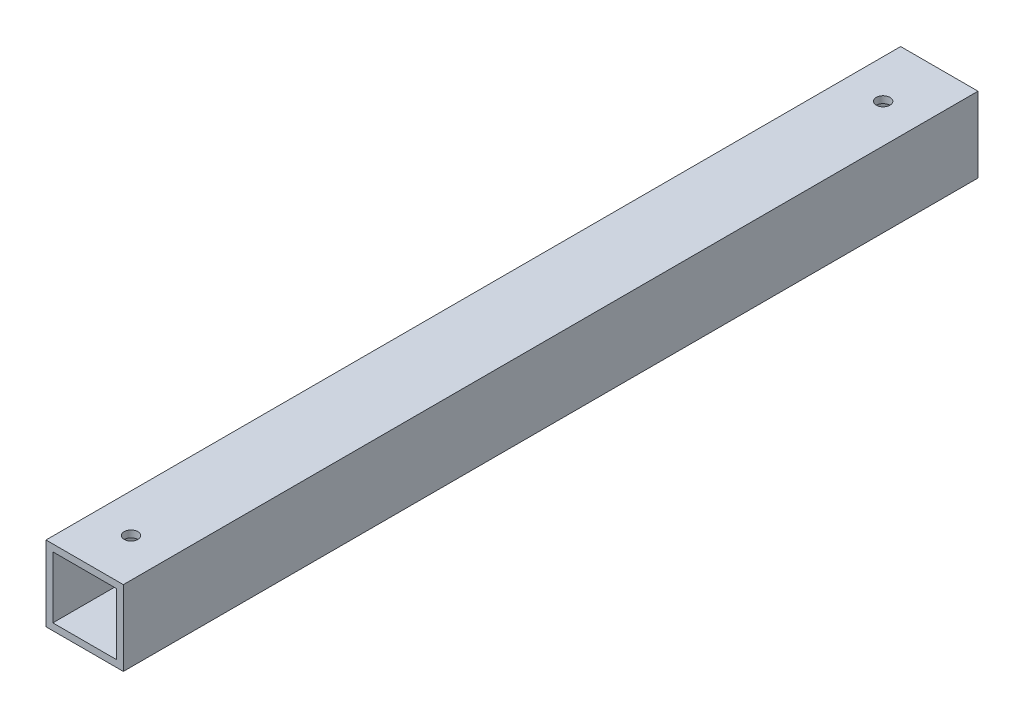
ISO-10303-21;
HEADER;
FILE_DESCRIPTION(('STEP AP214'),'2;1');
FILE_NAME('part.step','',(''),(''),'','','');
FILE_SCHEMA(('AUTOMOTIVE_DESIGN { 1 0 10303 214 1 1 1 1 }'));
ENDSEC;
DATA;
#1=APPLICATION_CONTEXT('core data for automotive mechanical design processes');
#2=APPLICATION_PROTOCOL_DEFINITION('international standard','automotive_design',2000,#1);
#3=PRODUCT_CONTEXT('',#1,'mechanical');
#4=PRODUCT('Part','Part','',(#3));
#5=PRODUCT_RELATED_PRODUCT_CATEGORY('part','',(#4));
#6=PRODUCT_DEFINITION_FORMATION('','',#4);
#7=PRODUCT_DEFINITION_CONTEXT('part definition',#1,'design');
#8=PRODUCT_DEFINITION('design','',#6,#7);
#9=PRODUCT_DEFINITION_SHAPE('','',#8);
#10=(LENGTH_UNIT() NAMED_UNIT(*) SI_UNIT(.MILLI.,.METRE.));
#11=(NAMED_UNIT(*) PLANE_ANGLE_UNIT() SI_UNIT($,.RADIAN.));
#12=(NAMED_UNIT(*) SI_UNIT($,.STERADIAN.) SOLID_ANGLE_UNIT());
#13=UNCERTAINTY_MEASURE_WITH_UNIT(LENGTH_MEASURE(1.E-05),#10,'distance_accuracy_value','');
#14=(GEOMETRIC_REPRESENTATION_CONTEXT(3) GLOBAL_UNCERTAINTY_ASSIGNED_CONTEXT((#13)) GLOBAL_UNIT_ASSIGNED_CONTEXT((#10,
#11,#12)) REPRESENTATION_CONTEXT('',''));
#15=CARTESIAN_POINT('',(0.,0.,0.));
#16=DIRECTION('',(0.,0.,1.));
#17=DIRECTION('',(1.,0.,0.));
#18=AXIS2_PLACEMENT_3D('',#15,#16,#17);
#19=CARTESIAN_POINT('',(0.,0.,250.));
#20=DIRECTION('',(0.,0.,1.));
#21=DIRECTION('',(1.,0.,0.));
#22=AXIS2_PLACEMENT_3D('',#19,#20,#21);
#23=PLANE('',#22);
#24=DIRECTION('',(0.,1.,0.));
#25=VECTOR('',#24,1.);
#26=CARTESIAN_POINT('',(22.625,20.,250.));
#27=LINE('',#26,#25);
#28=CARTESIAN_POINT('',(22.625,-22.,250.));
#29=VERTEX_POINT('',#28);
#30=CARTESIAN_POINT('',(22.625,22.,250.));
#31=VERTEX_POINT('',#30);
#32=EDGE_CURVE('E180',#29,#31,#27,.T.);
#33=ORIENTED_EDGE('',*,*,#32,.T.);
#34=DIRECTION('',(-1.,0.,0.));
#35=VECTOR('',#34,1.);
#36=CARTESIAN_POINT('',(-20.625,22.,250.));
#37=LINE('',#36,#35);
#38=CARTESIAN_POINT('',(-22.625,22.,250.));
#39=VERTEX_POINT('',#38);
#40=EDGE_CURVE('E184',#31,#39,#37,.T.);
#41=ORIENTED_EDGE('',*,*,#40,.T.);
#42=DIRECTION('',(0.,-1.,0.));
#43=VECTOR('',#42,1.);
#44=CARTESIAN_POINT('',(-22.625,20.,250.));
#45=LINE('',#44,#43);
#46=CARTESIAN_POINT('',(-22.625,-22.,250.));
#47=VERTEX_POINT('',#46);
#48=EDGE_CURVE('E188',#39,#47,#45,.T.);
#49=ORIENTED_EDGE('',*,*,#48,.T.);
#50=DIRECTION('',(1.,0.,0.));
#51=VECTOR('',#50,1.);
#52=CARTESIAN_POINT('',(-20.625,-22.,250.));
#53=LINE('',#52,#51);
#54=EDGE_CURVE('E191',#47,#29,#53,.T.);
#55=ORIENTED_EDGE('',*,*,#54,.T.);
#56=EDGE_LOOP('',(#33,#41,#49,#55));
#57=FACE_BOUND('',#56,.T.);
#58=DIRECTION('',(-1.,0.,0.));
#59=VECTOR('',#58,1.);
#60=CARTESIAN_POINT('',(-20.625,18.,250.));
#61=LINE('',#60,#59);
#62=CARTESIAN_POINT('',(18.625,18.,250.));
#63=VERTEX_POINT('',#62);
#64=CARTESIAN_POINT('',(-18.625,18.,250.));
#65=VERTEX_POINT('',#64);
#66=EDGE_CURVE('E139',#63,#65,#61,.T.);
#67=ORIENTED_EDGE('',*,*,#66,.F.);
#68=DIRECTION('',(0.,1.,0.));
#69=VECTOR('',#68,1.);
#70=CARTESIAN_POINT('',(18.625,20.,250.));
#71=LINE('',#70,#69);
#72=CARTESIAN_POINT('',(18.625,-18.,250.));
#73=VERTEX_POINT('',#72);
#74=EDGE_CURVE('E130',#73,#63,#71,.T.);
#75=ORIENTED_EDGE('',*,*,#74,.F.);
#76=DIRECTION('',(1.,0.,0.));
#77=VECTOR('',#76,1.);
#78=CARTESIAN_POINT('',(-20.625,-18.,250.));
#79=LINE('',#78,#77);
#80=CARTESIAN_POINT('',(-18.625,-18.,250.));
#81=VERTEX_POINT('',#80);
#82=EDGE_CURVE('E156',#81,#73,#79,.T.);
#83=ORIENTED_EDGE('',*,*,#82,.F.);
#84=DIRECTION('',(0.,-1.,0.));
#85=VECTOR('',#84,1.);
#86=CARTESIAN_POINT('',(-18.625,20.,250.));
#87=LINE('',#86,#85);
#88=EDGE_CURVE('E152',#65,#81,#87,.T.);
#89=ORIENTED_EDGE('',*,*,#88,.F.);
#90=EDGE_LOOP('',(#67,#75,#83,#89));
#91=FACE_BOUND('',#90,.T.);
#92=ADVANCED_FACE('F62',(#57,#91),#23,.T.);
#93=CARTESIAN_POINT('',(0.,0.,-250.));
#94=DIRECTION('',(0.,0.,1.));
#95=DIRECTION('',(1.,0.,0.));
#96=AXIS2_PLACEMENT_3D('',#93,#94,#95);
#97=PLANE('',#96);
#98=DIRECTION('',(0.,1.,0.));
#99=VECTOR('',#98,1.);
#100=CARTESIAN_POINT('',(22.625,20.,-250.));
#101=LINE('',#100,#99);
#102=CARTESIAN_POINT('',(22.625,-22.,-250.));
#103=VERTEX_POINT('',#102);
#104=CARTESIAN_POINT('',(22.625,22.,-250.));
#105=VERTEX_POINT('',#104);
#106=EDGE_CURVE('E148',#103,#105,#101,.T.);
#107=ORIENTED_EDGE('',*,*,#106,.F.);
#108=DIRECTION('',(1.,0.,0.));
#109=VECTOR('',#108,1.);
#110=CARTESIAN_POINT('',(-20.625,-22.,-250.));
#111=LINE('',#110,#109);
#112=CARTESIAN_POINT('',(-22.625,-22.,-250.));
#113=VERTEX_POINT('',#112);
#114=EDGE_CURVE('E185',#113,#103,#111,.T.);
#115=ORIENTED_EDGE('',*,*,#114,.F.);
#116=DIRECTION('',(0.,-1.,0.));
#117=VECTOR('',#116,1.);
#118=CARTESIAN_POINT('',(-22.625,20.,-250.));
#119=LINE('',#118,#117);
#120=CARTESIAN_POINT('',(-22.625,22.,-250.));
#121=VERTEX_POINT('',#120);
#122=EDGE_CURVE('E201',#121,#113,#119,.T.);
#123=ORIENTED_EDGE('',*,*,#122,.F.);
#124=DIRECTION('',(-1.,0.,0.));
#125=VECTOR('',#124,1.);
#126=CARTESIAN_POINT('',(-20.625,22.,-250.));
#127=LINE('',#126,#125);
#128=EDGE_CURVE('E198',#105,#121,#127,.T.);
#129=ORIENTED_EDGE('',*,*,#128,.F.);
#130=EDGE_LOOP('',(#107,#115,#123,#129));
#131=FACE_BOUND('',#130,.T.);
#132=DIRECTION('',(0.,1.,0.));
#133=VECTOR('',#132,1.);
#134=CARTESIAN_POINT('',(18.625,20.,-250.));
#135=LINE('',#134,#133);
#136=CARTESIAN_POINT('',(18.625,-18.,-250.));
#137=VERTEX_POINT('',#136);
#138=CARTESIAN_POINT('',(18.625,18.,-250.));
#139=VERTEX_POINT('',#138);
#140=EDGE_CURVE('E88',#137,#139,#135,.T.);
#141=ORIENTED_EDGE('',*,*,#140,.T.);
#142=DIRECTION('',(-1.,0.,0.));
#143=VECTOR('',#142,1.);
#144=CARTESIAN_POINT('',(-20.625,18.,-250.));
#145=LINE('',#144,#143);
#146=CARTESIAN_POINT('',(-18.625,18.,-250.));
#147=VERTEX_POINT('',#146);
#148=EDGE_CURVE('E146',#139,#147,#145,.T.);
#149=ORIENTED_EDGE('',*,*,#148,.T.);
#150=DIRECTION('',(0.,-1.,0.));
#151=VECTOR('',#150,1.);
#152=CARTESIAN_POINT('',(-18.625,20.,-250.));
#153=LINE('',#152,#151);
#154=CARTESIAN_POINT('',(-18.625,-18.,-250.));
#155=VERTEX_POINT('',#154);
#156=EDGE_CURVE('E167',#147,#155,#153,.T.);
#157=ORIENTED_EDGE('',*,*,#156,.T.);
#158=DIRECTION('',(1.,0.,0.));
#159=VECTOR('',#158,1.);
#160=CARTESIAN_POINT('',(-20.625,-18.,-250.));
#161=LINE('',#160,#159);
#162=EDGE_CURVE('E140',#155,#137,#161,.T.);
#163=ORIENTED_EDGE('',*,*,#162,.T.);
#164=EDGE_LOOP('',(#141,#149,#157,#163));
#165=FACE_BOUND('',#164,.T.);
#166=ADVANCED_FACE('F261',(#131,#165),#97,.F.);
#167=CARTESIAN_POINT('',(22.625,20.,250.));
#168=DIRECTION('',(-1.,0.,0.));
#169=DIRECTION('',(0.,0.,1.));
#170=AXIS2_PLACEMENT_3D('',#167,#168,#169);
#171=PLANE('',#170);
#172=ORIENTED_EDGE('',*,*,#106,.T.);
#173=DIRECTION('',(0.,0.,-1.));
#174=VECTOR('',#173,1.);
#175=CARTESIAN_POINT('',(22.625,22.,250.));
#176=LINE('',#175,#174);
#177=EDGE_CURVE('E12',#31,#105,#176,.T.);
#178=ORIENTED_EDGE('',*,*,#177,.F.);
#179=ORIENTED_EDGE('',*,*,#32,.F.);
#180=DIRECTION('',(0.,0.,-1.));
#181=VECTOR('',#180,1.);
#182=CARTESIAN_POINT('',(22.625,-22.,250.));
#183=LINE('',#182,#181);
#184=EDGE_CURVE('E194',#29,#103,#183,.T.);
#185=ORIENTED_EDGE('',*,*,#184,.T.);
#186=EDGE_LOOP('',(#172,#178,#179,#185));
#187=FACE_BOUND('',#186,.T.);
#188=ADVANCED_FACE('F64',(#187),#171,.F.);
#189=CARTESIAN_POINT('',(-20.625,22.,250.));
#190=DIRECTION('',(0.,-1.,0.));
#191=DIRECTION('',(0.,0.,-1.));
#192=AXIS2_PLACEMENT_3D('',#189,#190,#191);
#193=PLANE('',#192);
#194=CARTESIAN_POINT('',(0.,22.,-217.131701202633));
#195=DIRECTION('',(0.,1.,0.));
#196=DIRECTION('',(0.,0.,1.));
#197=AXIS2_PLACEMENT_3D('',#194,#195,#196);
#198=CIRCLE('',#197,4.);
#199=CARTESIAN_POINT('',(0.,22.,-213.131701202633));
#200=VERTEX_POINT('',#199);
#201=EDGE_CURVE('E227',#200,#200,#198,.T.);
#202=ORIENTED_EDGE('',*,*,#201,.F.);
#203=EDGE_LOOP('',(#202));
#204=FACE_BOUND('',#203,.T.);
#205=CARTESIAN_POINT('',(0.,22.,222.868298797367));
#206=DIRECTION('',(0.,1.,0.));
#207=DIRECTION('',(0.,0.,1.));
#208=AXIS2_PLACEMENT_3D('',#205,#206,#207);
#209=CIRCLE('',#208,4.);
#210=CARTESIAN_POINT('',(0.,22.,226.868298797367));
#211=VERTEX_POINT('',#210);
#212=EDGE_CURVE('E239',#211,#211,#209,.T.);
#213=ORIENTED_EDGE('',*,*,#212,.F.);
#214=EDGE_LOOP('',(#213));
#215=FACE_BOUND('',#214,.T.);
#216=ORIENTED_EDGE('',*,*,#128,.T.);
#217=DIRECTION('',(0.,0.,-1.));
#218=VECTOR('',#217,1.);
#219=CARTESIAN_POINT('',(-22.625,22.,250.));
#220=LINE('',#219,#218);
#221=EDGE_CURVE('E72',#39,#121,#220,.T.);
#222=ORIENTED_EDGE('',*,*,#221,.F.);
#223=ORIENTED_EDGE('',*,*,#40,.F.);
#224=ORIENTED_EDGE('',*,*,#177,.T.);
#225=EDGE_LOOP('',(#216,#222,#223,#224));
#226=FACE_BOUND('',#225,.T.);
#227=ADVANCED_FACE('F287',(#204,#215,#226),#193,.F.);
#228=CARTESIAN_POINT('',(-22.625,20.,250.));
#229=DIRECTION('',(1.,0.,0.));
#230=DIRECTION('',(0.,0.,-1.));
#231=AXIS2_PLACEMENT_3D('',#228,#229,#230);
#232=PLANE('',#231);
#233=ORIENTED_EDGE('',*,*,#122,.T.);
#234=DIRECTION('',(0.,0.,-1.));
#235=VECTOR('',#234,1.);
#236=CARTESIAN_POINT('',(-22.625,-22.,250.));
#237=LINE('',#236,#235);
#238=EDGE_CURVE('E209',#47,#113,#237,.T.);
#239=ORIENTED_EDGE('',*,*,#238,.F.);
#240=ORIENTED_EDGE('',*,*,#48,.F.);
#241=ORIENTED_EDGE('',*,*,#221,.T.);
#242=EDGE_LOOP('',(#233,#239,#240,#241));
#243=FACE_BOUND('',#242,.T.);
#244=ADVANCED_FACE('F285',(#243),#232,.F.);
#245=CARTESIAN_POINT('',(-20.625,-22.,250.));
#246=DIRECTION('',(0.,1.,0.));
#247=DIRECTION('',(0.,0.,1.));
#248=AXIS2_PLACEMENT_3D('',#245,#246,#247);
#249=PLANE('',#248);
#250=CARTESIAN_POINT('',(0.,-22.,-217.131701202633));
#251=DIRECTION('',(0.,1.,0.));
#252=DIRECTION('',(0.,0.,1.));
#253=AXIS2_PLACEMENT_3D('',#250,#251,#252);
#254=CIRCLE('',#253,4.);
#255=CARTESIAN_POINT('',(0.,-22.,-213.131701202633));
#256=VERTEX_POINT('',#255);
#257=EDGE_CURVE('E219',#256,#256,#254,.T.);
#258=ORIENTED_EDGE('',*,*,#257,.T.);
#259=EDGE_LOOP('',(#258));
#260=FACE_BOUND('',#259,.T.);
#261=CARTESIAN_POINT('',(0.,-22.,222.868298797367));
#262=DIRECTION('',(0.,1.,0.));
#263=DIRECTION('',(0.,0.,1.));
#264=AXIS2_PLACEMENT_3D('',#261,#262,#263);
#265=CIRCLE('',#264,4.);
#266=CARTESIAN_POINT('',(0.,-22.,226.868298797367));
#267=VERTEX_POINT('',#266);
#268=EDGE_CURVE('E233',#267,#267,#265,.T.);
#269=ORIENTED_EDGE('',*,*,#268,.T.);
#270=EDGE_LOOP('',(#269));
#271=FACE_BOUND('',#270,.T.);
#272=ORIENTED_EDGE('',*,*,#114,.T.);
#273=ORIENTED_EDGE('',*,*,#184,.F.);
#274=ORIENTED_EDGE('',*,*,#54,.F.);
#275=ORIENTED_EDGE('',*,*,#238,.T.);
#276=EDGE_LOOP('',(#272,#273,#274,#275));
#277=FACE_BOUND('',#276,.T.);
#278=ADVANCED_FACE('F282',(#260,#271,#277),#249,.F.);
#279=CARTESIAN_POINT('',(18.625,20.,250.));
#280=DIRECTION('',(-1.,0.,0.));
#281=DIRECTION('',(0.,0.,1.));
#282=AXIS2_PLACEMENT_3D('',#279,#280,#281);
#283=PLANE('',#282);
#284=ORIENTED_EDGE('',*,*,#140,.F.);
#285=DIRECTION('',(0.,0.,-1.));
#286=VECTOR('',#285,1.);
#287=CARTESIAN_POINT('',(18.625,-18.,250.));
#288=LINE('',#287,#286);
#289=EDGE_CURVE('E134',#73,#137,#288,.T.);
#290=ORIENTED_EDGE('',*,*,#289,.F.);
#291=ORIENTED_EDGE('',*,*,#74,.T.);
#292=DIRECTION('',(0.,0.,-1.));
#293=VECTOR('',#292,1.);
#294=CARTESIAN_POINT('',(18.625,18.,250.));
#295=LINE('',#294,#293);
#296=EDGE_CURVE('E133',#63,#139,#295,.T.);
#297=ORIENTED_EDGE('',*,*,#296,.T.);
#298=EDGE_LOOP('',(#284,#290,#291,#297));
#299=FACE_BOUND('',#298,.T.);
#300=ADVANCED_FACE('F132',(#299),#283,.T.);
#301=CARTESIAN_POINT('',(-20.625,18.,250.));
#302=DIRECTION('',(0.,-1.,0.));
#303=DIRECTION('',(0.,0.,-1.));
#304=AXIS2_PLACEMENT_3D('',#301,#302,#303);
#305=PLANE('',#304);
#306=CARTESIAN_POINT('',(0.,18.,-217.131701202633));
#307=DIRECTION('',(0.,-1.,0.));
#308=DIRECTION('',(0.,0.,-1.));
#309=AXIS2_PLACEMENT_3D('',#306,#307,#308);
#310=CIRCLE('',#309,4.);
#311=CARTESIAN_POINT('',(0.,18.,-221.131701202633));
#312=VERTEX_POINT('',#311);
#313=EDGE_CURVE('E164',#312,#312,#310,.T.);
#314=ORIENTED_EDGE('',*,*,#313,.F.);
#315=EDGE_LOOP('',(#314));
#316=FACE_BOUND('',#315,.T.);
#317=CARTESIAN_POINT('',(0.,18.,222.868298797367));
#318=DIRECTION('',(0.,-1.,0.));
#319=DIRECTION('',(0.,0.,-1.));
#320=AXIS2_PLACEMENT_3D('',#317,#318,#319);
#321=CIRCLE('',#320,4.);
#322=CARTESIAN_POINT('',(0.,18.,218.868298797367));
#323=VERTEX_POINT('',#322);
#324=EDGE_CURVE('E218',#323,#323,#321,.T.);
#325=ORIENTED_EDGE('',*,*,#324,.F.);
#326=EDGE_LOOP('',(#325));
#327=FACE_BOUND('',#326,.T.);
#328=ORIENTED_EDGE('',*,*,#148,.F.);
#329=ORIENTED_EDGE('',*,*,#296,.F.);
#330=ORIENTED_EDGE('',*,*,#66,.T.);
#331=DIRECTION('',(0.,0.,-1.));
#332=VECTOR('',#331,1.);
#333=CARTESIAN_POINT('',(-18.625,18.,250.));
#334=LINE('',#333,#332);
#335=EDGE_CURVE('E149',#65,#147,#334,.T.);
#336=ORIENTED_EDGE('',*,*,#335,.T.);
#337=EDGE_LOOP('',(#328,#329,#330,#336));
#338=FACE_BOUND('',#337,.T.);
#339=ADVANCED_FACE('F143',(#316,#327,#338),#305,.T.);
#340=CARTESIAN_POINT('',(-18.625,20.,250.));
#341=DIRECTION('',(1.,0.,0.));
#342=DIRECTION('',(0.,0.,-1.));
#343=AXIS2_PLACEMENT_3D('',#340,#341,#342);
#344=PLANE('',#343);
#345=ORIENTED_EDGE('',*,*,#156,.F.);
#346=ORIENTED_EDGE('',*,*,#335,.F.);
#347=ORIENTED_EDGE('',*,*,#88,.T.);
#348=DIRECTION('',(0.,0.,-1.));
#349=VECTOR('',#348,1.);
#350=CARTESIAN_POINT('',(-18.625,-18.,250.));
#351=LINE('',#350,#349);
#352=EDGE_CURVE('E80',#81,#155,#351,.T.);
#353=ORIENTED_EDGE('',*,*,#352,.T.);
#354=EDGE_LOOP('',(#345,#346,#347,#353));
#355=FACE_BOUND('',#354,.T.);
#356=ADVANCED_FACE('F257',(#355),#344,.T.);
#357=CARTESIAN_POINT('',(-20.625,-18.,250.));
#358=DIRECTION('',(0.,1.,0.));
#359=DIRECTION('',(0.,0.,1.));
#360=AXIS2_PLACEMENT_3D('',#357,#358,#359);
#361=PLANE('',#360);
#362=CARTESIAN_POINT('',(0.,-18.,-217.131701202633));
#363=DIRECTION('',(0.,1.,0.));
#364=DIRECTION('',(0.,0.,1.));
#365=AXIS2_PLACEMENT_3D('',#362,#363,#364);
#366=CIRCLE('',#365,4.);
#367=CARTESIAN_POINT('',(0.,-18.,-213.131701202633));
#368=VERTEX_POINT('',#367);
#369=EDGE_CURVE('E66',#368,#368,#366,.T.);
#370=ORIENTED_EDGE('',*,*,#369,.F.);
#371=EDGE_LOOP('',(#370));
#372=FACE_BOUND('',#371,.T.);
#373=CARTESIAN_POINT('',(0.,-18.,222.868298797367));
#374=DIRECTION('',(0.,1.,0.));
#375=DIRECTION('',(0.,0.,1.));
#376=AXIS2_PLACEMENT_3D('',#373,#374,#375);
#377=CIRCLE('',#376,4.);
#378=CARTESIAN_POINT('',(0.,-18.,226.868298797367));
#379=VERTEX_POINT('',#378);
#380=EDGE_CURVE('E215',#379,#379,#377,.T.);
#381=ORIENTED_EDGE('',*,*,#380,.F.);
#382=EDGE_LOOP('',(#381));
#383=FACE_BOUND('',#382,.T.);
#384=ORIENTED_EDGE('',*,*,#162,.F.);
#385=ORIENTED_EDGE('',*,*,#352,.F.);
#386=ORIENTED_EDGE('',*,*,#82,.T.);
#387=ORIENTED_EDGE('',*,*,#289,.T.);
#388=EDGE_LOOP('',(#384,#385,#386,#387));
#389=FACE_BOUND('',#388,.T.);
#390=ADVANCED_FACE('F253',(#372,#383,#389),#361,.T.);
#391=CARTESIAN_POINT('',(0.,-22.,222.868298797367));
#392=DIRECTION('',(0.,1.,0.));
#393=DIRECTION('',(0.,0.,1.));
#394=AXIS2_PLACEMENT_3D('',#391,#392,#393);
#395=CYLINDRICAL_SURFACE('',#394,4.);
#396=ORIENTED_EDGE('',*,*,#380,.T.);
#397=EDGE_LOOP('',(#396));
#398=FACE_BOUND('',#397,.T.);
#399=ORIENTED_EDGE('',*,*,#268,.F.);
#400=EDGE_LOOP('',(#399));
#401=FACE_BOUND('',#400,.T.);
#402=ADVANCED_FACE('F256',(#398,#401),#395,.F.);
#403=CARTESIAN_POINT('',(0.,-22.,-217.131701202633));
#404=DIRECTION('',(0.,1.,0.));
#405=DIRECTION('',(0.,0.,1.));
#406=AXIS2_PLACEMENT_3D('',#403,#404,#405);
#407=CYLINDRICAL_SURFACE('',#406,4.);
#408=ORIENTED_EDGE('',*,*,#369,.T.);
#409=EDGE_LOOP('',(#408));
#410=FACE_BOUND('',#409,.T.);
#411=ORIENTED_EDGE('',*,*,#257,.F.);
#412=EDGE_LOOP('',(#411));
#413=FACE_BOUND('',#412,.T.);
#414=ADVANCED_FACE('F250',(#410,#413),#407,.F.);
#415=ORIENTED_EDGE('',*,*,#324,.T.);
#416=EDGE_LOOP('',(#415));
#417=FACE_BOUND('',#416,.T.);
#418=ORIENTED_EDGE('',*,*,#212,.T.);
#419=EDGE_LOOP('',(#418));
#420=FACE_BOUND('',#419,.T.);
#421=ADVANCED_FACE('F311',(#417,#420),#395,.F.);
#422=ORIENTED_EDGE('',*,*,#313,.T.);
#423=EDGE_LOOP('',(#422));
#424=FACE_BOUND('',#423,.T.);
#425=ORIENTED_EDGE('',*,*,#201,.T.);
#426=EDGE_LOOP('',(#425));
#427=FACE_BOUND('',#426,.T.);
#428=ADVANCED_FACE('F313',(#424,#427),#407,.F.);
#429=CLOSED_SHELL('',(#92,#166,#188,#227,#244,#278,#300,#339,#356,#390,#402,#414,#421,#428));
#430=MANIFOLD_SOLID_BREP('B2',#429);
#431=ADVANCED_BREP_SHAPE_REPRESENTATION('',(#18,#430),#14);
#432=SHAPE_DEFINITION_REPRESENTATION(#9,#431);
ENDSEC;
END-ISO-10303-21;
